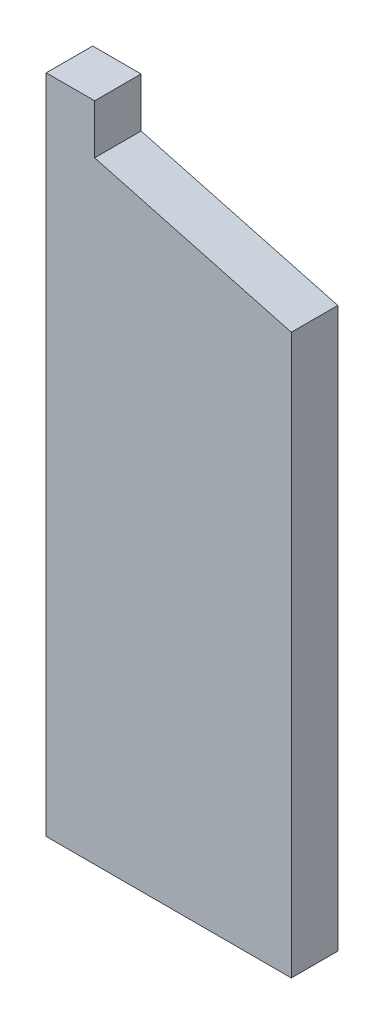
ISO-10303-21;
HEADER;
FILE_DESCRIPTION(('STEP AP214'),'2;1');
FILE_NAME('part.step','',(''),(''),'','','');
FILE_SCHEMA(('AUTOMOTIVE_DESIGN { 1 0 10303 214 1 1 1 1 }'));
ENDSEC;
DATA;
#1=APPLICATION_CONTEXT('core data for automotive mechanical design processes');
#2=APPLICATION_PROTOCOL_DEFINITION('international standard','automotive_design',2000,#1);
#3=PRODUCT_CONTEXT('',#1,'mechanical');
#4=PRODUCT('Part','Part','',(#3));
#5=PRODUCT_RELATED_PRODUCT_CATEGORY('part','',(#4));
#6=PRODUCT_DEFINITION_FORMATION('','',#4);
#7=PRODUCT_DEFINITION_CONTEXT('part definition',#1,'design');
#8=PRODUCT_DEFINITION('design','',#6,#7);
#9=PRODUCT_DEFINITION_SHAPE('','',#8);
#10=(LENGTH_UNIT() NAMED_UNIT(*) SI_UNIT(.MILLI.,.METRE.));
#11=(NAMED_UNIT(*) PLANE_ANGLE_UNIT() SI_UNIT($,.RADIAN.));
#12=(NAMED_UNIT(*) SI_UNIT($,.STERADIAN.) SOLID_ANGLE_UNIT());
#13=UNCERTAINTY_MEASURE_WITH_UNIT(LENGTH_MEASURE(1.E-05),#10,'distance_accuracy_value','');
#14=(GEOMETRIC_REPRESENTATION_CONTEXT(3) GLOBAL_UNCERTAINTY_ASSIGNED_CONTEXT((#13)) GLOBAL_UNIT_ASSIGNED_CONTEXT((#10,
#11,#12)) REPRESENTATION_CONTEXT('',''));
#15=CARTESIAN_POINT('',(0.,0.,0.));
#16=DIRECTION('',(0.,0.,1.));
#17=DIRECTION('',(1.,0.,0.));
#18=AXIS2_PLACEMENT_3D('',#15,#16,#17);
#19=CARTESIAN_POINT('',(49.6,0.,9.4));
#20=DIRECTION('',(1.,0.,0.));
#21=DIRECTION('',(0.,1.,0.));
#22=AXIS2_PLACEMENT_3D('',#19,#20,#21);
#23=PLANE('',#22);
#24=DIRECTION('',(0.,-1.,0.));
#25=VECTOR('',#24,1.);
#26=CARTESIAN_POINT('',(49.6,0.,0.));
#27=LINE('',#26,#25);
#28=CARTESIAN_POINT('',(49.6,-20.6643778587587,0.));
#29=VERTEX_POINT('',#28);
#30=CARTESIAN_POINT('',(49.6,-133.83,0.));
#31=VERTEX_POINT('',#30);
#32=EDGE_CURVE('E112',#29,#31,#27,.T.);
#33=ORIENTED_EDGE('',*,*,#32,.F.);
#34=DIRECTION('',(0.,0.,-1.));
#35=VECTOR('',#34,1.);
#36=CARTESIAN_POINT('',(49.6,-20.6643778587587,199.943652449549));
#37=LINE('',#36,#35);
#38=CARTESIAN_POINT('',(49.6,-20.6643778587587,9.4));
#39=VERTEX_POINT('',#38);
#40=EDGE_CURVE('E52',#39,#29,#37,.T.);
#41=ORIENTED_EDGE('',*,*,#40,.F.);
#42=DIRECTION('',(0.,-1.,0.));
#43=VECTOR('',#42,1.);
#44=CARTESIAN_POINT('',(49.6,0.,9.4));
#45=LINE('',#44,#43);
#46=CARTESIAN_POINT('',(49.6,-133.83,9.4));
#47=VERTEX_POINT('',#46);
#48=EDGE_CURVE('E117',#39,#47,#45,.T.);
#49=ORIENTED_EDGE('',*,*,#48,.T.);
#50=DIRECTION('',(0.,0.,-1.));
#51=VECTOR('',#50,1.);
#52=CARTESIAN_POINT('',(49.6,-133.83,9.4));
#53=LINE('',#52,#51);
#54=EDGE_CURVE('E119',#47,#31,#53,.T.);
#55=ORIENTED_EDGE('',*,*,#54,.T.);
#56=EDGE_LOOP('',(#33,#41,#49,#55));
#57=FACE_BOUND('',#56,.T.);
#58=ADVANCED_FACE('F37',(#57),#23,.T.);
#59=CARTESIAN_POINT('',(0.,0.,9.4));
#60=DIRECTION('',(0.,0.,1.));
#61=DIRECTION('',(1.,0.,0.));
#62=AXIS2_PLACEMENT_3D('',#59,#60,#61);
#63=PLANE('',#62);
#64=ORIENTED_EDGE('',*,*,#48,.F.);
#65=DIRECTION('',(-0.965925826289068,0.258819045102521,0.));
#66=VECTOR('',#65,1.);
#67=CARTESIAN_POINT('',(-1.84352447854375,-6.88012701892219,9.4));
#68=LINE('',#67,#66);
#69=CARTESIAN_POINT('',(9.79999999999999,-10.,9.4));
#70=VERTEX_POINT('',#69);
#71=EDGE_CURVE('E94',#39,#70,#68,.T.);
#72=ORIENTED_EDGE('',*,*,#71,.T.);
#73=DIRECTION('',(0.,-1.,0.));
#74=VECTOR('',#73,1.);
#75=CARTESIAN_POINT('',(9.8,0.,9.4));
#76=LINE('',#75,#74);
#77=CARTESIAN_POINT('',(9.8,0.,9.4));
#78=VERTEX_POINT('',#77);
#79=EDGE_CURVE('E99',#78,#70,#76,.T.);
#80=ORIENTED_EDGE('',*,*,#79,.F.);
#81=DIRECTION('',(1.,0.,0.));
#82=VECTOR('',#81,1.);
#83=CARTESIAN_POINT('',(0.,0.,9.4));
#84=LINE('',#83,#82);
#85=CARTESIAN_POINT('',(0.,0.,9.4));
#86=VERTEX_POINT('',#85);
#87=EDGE_CURVE('E107',#86,#78,#84,.T.);
#88=ORIENTED_EDGE('',*,*,#87,.F.);
#89=DIRECTION('',(0.,-1.,0.));
#90=VECTOR('',#89,1.);
#91=CARTESIAN_POINT('',(0.,0.,9.4));
#92=LINE('',#91,#90);
#93=CARTESIAN_POINT('',(0.,-133.83,9.4));
#94=VERTEX_POINT('',#93);
#95=EDGE_CURVE('E110',#86,#94,#92,.T.);
#96=ORIENTED_EDGE('',*,*,#95,.T.);
#97=DIRECTION('',(1.,0.,0.));
#98=VECTOR('',#97,1.);
#99=CARTESIAN_POINT('',(0.,-133.83,9.4));
#100=LINE('',#99,#98);
#101=EDGE_CURVE('E114',#94,#47,#100,.T.);
#102=ORIENTED_EDGE('',*,*,#101,.T.);
#103=EDGE_LOOP('',(#64,#72,#80,#88,#96,#102));
#104=FACE_BOUND('',#103,.T.);
#105=ADVANCED_FACE('F138',(#104),#63,.T.);
#106=CARTESIAN_POINT('',(0.,0.,0.));
#107=DIRECTION('',(0.,0.,1.));
#108=DIRECTION('',(1.,0.,0.));
#109=AXIS2_PLACEMENT_3D('',#106,#107,#108);
#110=PLANE('',#109);
#111=DIRECTION('',(-0.965925826289068,0.258819045102521,0.));
#112=VECTOR('',#111,1.);
#113=CARTESIAN_POINT('',(-1.84352447854375,-6.88012701892219,0.));
#114=LINE('',#113,#112);
#115=CARTESIAN_POINT('',(9.79999999999999,-10.,0.));
#116=VERTEX_POINT('',#115);
#117=EDGE_CURVE('E11',#29,#116,#114,.T.);
#118=ORIENTED_EDGE('',*,*,#117,.F.);
#119=ORIENTED_EDGE('',*,*,#32,.T.);
#120=DIRECTION('',(1.,0.,0.));
#121=VECTOR('',#120,1.);
#122=CARTESIAN_POINT('',(0.,-133.83,0.));
#123=LINE('',#122,#121);
#124=CARTESIAN_POINT('',(0.,-133.83,0.));
#125=VERTEX_POINT('',#124);
#126=EDGE_CURVE('E123',#125,#31,#123,.T.);
#127=ORIENTED_EDGE('',*,*,#126,.F.);
#128=DIRECTION('',(0.,-1.,0.));
#129=VECTOR('',#128,1.);
#130=CARTESIAN_POINT('',(0.,0.,0.));
#131=LINE('',#130,#129);
#132=CARTESIAN_POINT('',(0.,0.,0.));
#133=VERTEX_POINT('',#132);
#134=EDGE_CURVE('E120',#133,#125,#131,.T.);
#135=ORIENTED_EDGE('',*,*,#134,.F.);
#136=DIRECTION('',(1.,0.,0.));
#137=VECTOR('',#136,1.);
#138=CARTESIAN_POINT('',(0.,0.,0.));
#139=LINE('',#138,#137);
#140=CARTESIAN_POINT('',(9.8,0.,0.));
#141=VERTEX_POINT('',#140);
#142=EDGE_CURVE('E92',#133,#141,#139,.T.);
#143=ORIENTED_EDGE('',*,*,#142,.T.);
#144=DIRECTION('',(0.,-1.,0.));
#145=VECTOR('',#144,1.);
#146=CARTESIAN_POINT('',(9.8,0.,0.));
#147=LINE('',#146,#145);
#148=EDGE_CURVE('E87',#141,#116,#147,.T.);
#149=ORIENTED_EDGE('',*,*,#148,.T.);
#150=EDGE_LOOP('',(#118,#119,#127,#135,#143,#149));
#151=FACE_BOUND('',#150,.T.);
#152=ADVANCED_FACE('F89',(#151),#110,.F.);
#153=CARTESIAN_POINT('',(9.8,0.,9.4));
#154=DIRECTION('',(1.,0.,0.));
#155=DIRECTION('',(0.,1.,0.));
#156=AXIS2_PLACEMENT_3D('',#153,#154,#155);
#157=PLANE('',#156);
#158=ORIENTED_EDGE('',*,*,#148,.F.);
#159=DIRECTION('',(0.,0.,-1.));
#160=VECTOR('',#159,1.);
#161=CARTESIAN_POINT('',(9.8,0.,9.4));
#162=LINE('',#161,#160);
#163=EDGE_CURVE('E102',#78,#141,#162,.T.);
#164=ORIENTED_EDGE('',*,*,#163,.F.);
#165=ORIENTED_EDGE('',*,*,#79,.T.);
#166=DIRECTION('',(0.,0.,-1.));
#167=VECTOR('',#166,1.);
#168=CARTESIAN_POINT('',(9.79999999999999,-10.,9.4));
#169=LINE('',#168,#167);
#170=EDGE_CURVE('E45',#70,#116,#169,.T.);
#171=ORIENTED_EDGE('',*,*,#170,.T.);
#172=EDGE_LOOP('',(#158,#164,#165,#171));
#173=FACE_BOUND('',#172,.T.);
#174=ADVANCED_FACE('F39',(#173),#157,.T.);
#175=CARTESIAN_POINT('',(0.,0.,9.4));
#176=DIRECTION('',(0.,1.,0.));
#177=DIRECTION('',(0.,0.,1.));
#178=AXIS2_PLACEMENT_3D('',#175,#176,#177);
#179=PLANE('',#178);
#180=ORIENTED_EDGE('',*,*,#142,.F.);
#181=DIRECTION('',(0.,0.,-1.));
#182=VECTOR('',#181,1.);
#183=CARTESIAN_POINT('',(0.,0.,9.4));
#184=LINE('',#183,#182);
#185=EDGE_CURVE('E132',#86,#133,#184,.T.);
#186=ORIENTED_EDGE('',*,*,#185,.F.);
#187=ORIENTED_EDGE('',*,*,#87,.T.);
#188=ORIENTED_EDGE('',*,*,#163,.T.);
#189=EDGE_LOOP('',(#180,#186,#187,#188));
#190=FACE_BOUND('',#189,.T.);
#191=ADVANCED_FACE('F135',(#190),#179,.T.);
#192=CARTESIAN_POINT('',(0.,0.,9.4));
#193=DIRECTION('',(1.,0.,0.));
#194=DIRECTION('',(0.,1.,0.));
#195=AXIS2_PLACEMENT_3D('',#192,#193,#194);
#196=PLANE('',#195);
#197=ORIENTED_EDGE('',*,*,#134,.T.);
#198=DIRECTION('',(0.,0.,-1.));
#199=VECTOR('',#198,1.);
#200=CARTESIAN_POINT('',(0.,-133.83,9.4));
#201=LINE('',#200,#199);
#202=EDGE_CURVE('E129',#94,#125,#201,.T.);
#203=ORIENTED_EDGE('',*,*,#202,.F.);
#204=ORIENTED_EDGE('',*,*,#95,.F.);
#205=ORIENTED_EDGE('',*,*,#185,.T.);
#206=EDGE_LOOP('',(#197,#203,#204,#205));
#207=FACE_BOUND('',#206,.T.);
#208=ADVANCED_FACE('F146',(#207),#196,.F.);
#209=CARTESIAN_POINT('',(0.,-133.83,9.4));
#210=DIRECTION('',(0.,1.,0.));
#211=DIRECTION('',(0.,0.,1.));
#212=AXIS2_PLACEMENT_3D('',#209,#210,#211);
#213=PLANE('',#212);
#214=ORIENTED_EDGE('',*,*,#126,.T.);
#215=ORIENTED_EDGE('',*,*,#54,.F.);
#216=ORIENTED_EDGE('',*,*,#101,.F.);
#217=ORIENTED_EDGE('',*,*,#202,.T.);
#218=EDGE_LOOP('',(#214,#215,#216,#217));
#219=FACE_BOUND('',#218,.T.);
#220=ADVANCED_FACE('F143',(#219),#213,.F.);
#221=CARTESIAN_POINT('',(9.79999999999999,-10.,199.943652449549));
#222=DIRECTION('',(0.258819045102521,0.965925826289068,0.));
#223=DIRECTION('',(-0.965925826289068,0.258819045102521,0.));
#224=AXIS2_PLACEMENT_3D('',#221,#222,#223);
#225=PLANE('',#224);
#226=ORIENTED_EDGE('',*,*,#71,.F.);
#227=ORIENTED_EDGE('',*,*,#40,.T.);
#228=ORIENTED_EDGE('',*,*,#117,.T.);
#229=ORIENTED_EDGE('',*,*,#170,.F.);
#230=EDGE_LOOP('',(#226,#227,#228,#229));
#231=FACE_BOUND('',#230,.T.);
#232=ADVANCED_FACE('F103',(#231),#225,.T.);
#233=CLOSED_SHELL('',(#58,#105,#152,#174,#191,#208,#220,#232));
#234=MANIFOLD_SOLID_BREP('B2',#233);
#235=ADVANCED_BREP_SHAPE_REPRESENTATION('',(#18,#234),#14);
#236=SHAPE_DEFINITION_REPRESENTATION(#9,#235);
ENDSEC;
END-ISO-10303-21;
